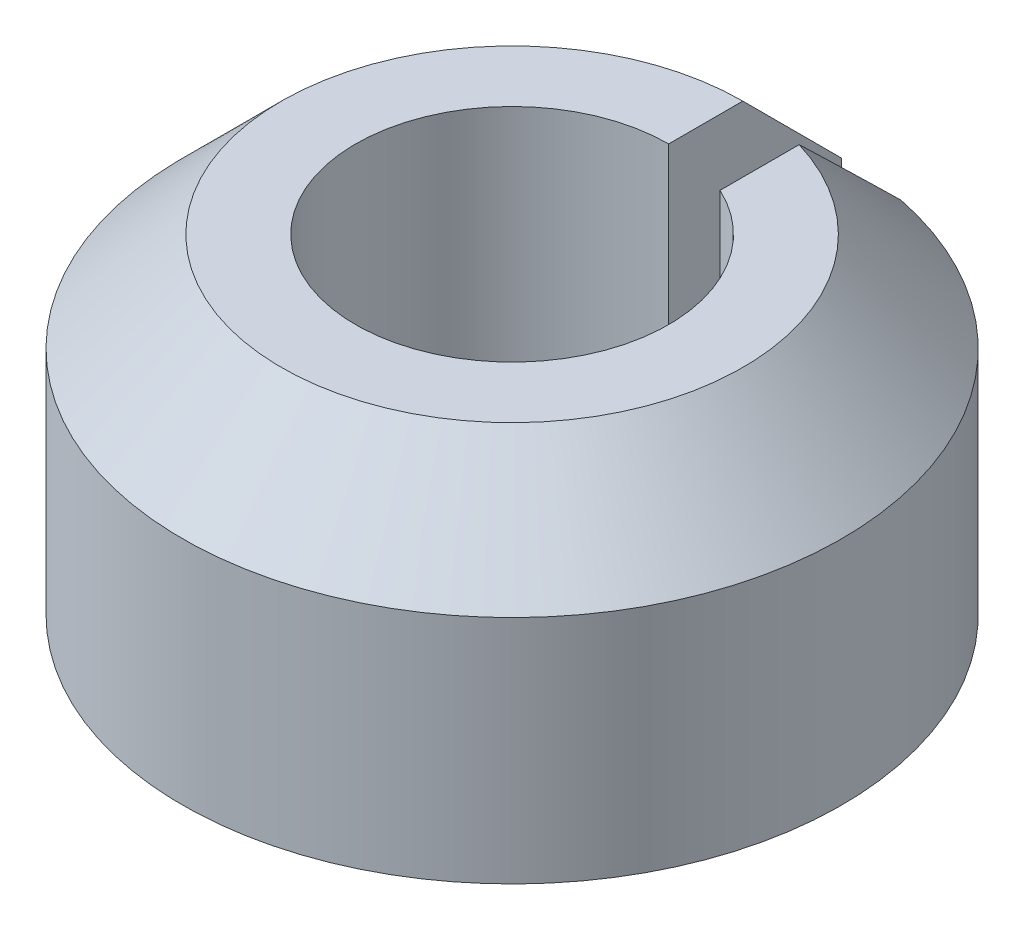
ISO-10303-21;
HEADER;
FILE_DESCRIPTION(('STEP AP214'),'2;1');
FILE_NAME('part.step','',(''),(''),'','','');
FILE_SCHEMA(('AUTOMOTIVE_DESIGN { 1 0 10303 214 1 1 1 1 }'));
ENDSEC;
DATA;
#1=APPLICATION_CONTEXT('core data for automotive mechanical design processes');
#2=APPLICATION_PROTOCOL_DEFINITION('international standard','automotive_design',2000,#1);
#3=PRODUCT_CONTEXT('',#1,'mechanical');
#4=PRODUCT('Part','Part','',(#3));
#5=PRODUCT_RELATED_PRODUCT_CATEGORY('part','',(#4));
#6=PRODUCT_DEFINITION_FORMATION('','',#4);
#7=PRODUCT_DEFINITION_CONTEXT('part definition',#1,'design');
#8=PRODUCT_DEFINITION('design','',#6,#7);
#9=PRODUCT_DEFINITION_SHAPE('','',#8);
#10=(LENGTH_UNIT() NAMED_UNIT(*) SI_UNIT(.MILLI.,.METRE.));
#11=(NAMED_UNIT(*) PLANE_ANGLE_UNIT() SI_UNIT($,.RADIAN.));
#12=(NAMED_UNIT(*) SI_UNIT($,.STERADIAN.) SOLID_ANGLE_UNIT());
#13=UNCERTAINTY_MEASURE_WITH_UNIT(LENGTH_MEASURE(1.E-05),#10,'distance_accuracy_value','');
#14=(GEOMETRIC_REPRESENTATION_CONTEXT(3) GLOBAL_UNCERTAINTY_ASSIGNED_CONTEXT((#13)) GLOBAL_UNIT_ASSIGNED_CONTEXT((#10,
#11,#12)) REPRESENTATION_CONTEXT('',''));
#15=CARTESIAN_POINT('',(0.,0.,0.));
#16=DIRECTION('',(0.,0.,1.));
#17=DIRECTION('',(1.,0.,0.));
#18=AXIS2_PLACEMENT_3D('',#15,#16,#17);
#19=CARTESIAN_POINT('',(0.,2.,0.));
#20=DIRECTION('',(0.,-1.,0.));
#21=DIRECTION('',(0.,0.,-1.));
#22=AXIS2_PLACEMENT_3D('',#19,#20,#21);
#23=CYLINDRICAL_SURFACE('',#22,0.95);
#24=CARTESIAN_POINT('',(0.,0.,0.));
#25=DIRECTION('',(0.,-1.,0.));
#26=DIRECTION('',(0.,0.,1.));
#27=AXIS2_PLACEMENT_3D('',#24,#25,#26);
#28=CIRCLE('',#27,0.95);
#29=CARTESIAN_POINT('',(0.4,0.,-0.861684396980704));
#30=VERTEX_POINT('',#29);
#31=CARTESIAN_POINT('',(0.,0.,-0.95));
#32=VERTEX_POINT('',#31);
#33=EDGE_CURVE('E112',#30,#32,#28,.T.);
#34=ORIENTED_EDGE('',*,*,#33,.T.);
#35=DIRECTION('',(0.,-1.,0.));
#36=VECTOR('',#35,1.);
#37=CARTESIAN_POINT('',(0.,2.,-0.95));
#38=LINE('',#37,#36);
#39=CARTESIAN_POINT('',(0.,2.,-0.95));
#40=VERTEX_POINT('',#39);
#41=EDGE_CURVE('E93',#40,#32,#38,.T.);
#42=ORIENTED_EDGE('',*,*,#41,.F.);
#43=CARTESIAN_POINT('',(0.,2.,0.));
#44=DIRECTION('',(0.,-1.,0.));
#45=DIRECTION('',(0.,0.,1.));
#46=AXIS2_PLACEMENT_3D('',#43,#44,#45);
#47=CIRCLE('',#46,0.95);
#48=CARTESIAN_POINT('',(0.4,2.,-0.861684396980704));
#49=VERTEX_POINT('',#48);
#50=EDGE_CURVE('E101',#49,#40,#47,.T.);
#51=ORIENTED_EDGE('',*,*,#50,.F.);
#52=DIRECTION('',(0.,-1.,0.));
#53=VECTOR('',#52,1.);
#54=CARTESIAN_POINT('',(0.4,2.,-0.861684396980704));
#55=LINE('',#54,#53);
#56=EDGE_CURVE('E196',#49,#30,#55,.T.);
#57=ORIENTED_EDGE('',*,*,#56,.T.);
#58=EDGE_LOOP('',(#34,#42,#51,#57));
#59=FACE_BOUND('',#58,.T.);
#60=ADVANCED_FACE('F40',(#59),#23,.F.);
#61=CARTESIAN_POINT('',(0.,2.,-0.95));
#62=DIRECTION('',(-1.,0.,0.));
#63=DIRECTION('',(0.,0.,1.));
#64=AXIS2_PLACEMENT_3D('',#61,#62,#63);
#65=PLANE('',#64);
#66=DIRECTION('',(0.,-1.,0.));
#67=VECTOR('',#66,1.);
#68=CARTESIAN_POINT('',(0.,2.,-2.));
#69=LINE('',#68,#67);
#70=CARTESIAN_POINT('',(0.,1.4,-2.));
#71=VERTEX_POINT('',#70);
#72=CARTESIAN_POINT('',(0.,0.,-2.));
#73=VERTEX_POINT('',#72);
#74=EDGE_CURVE('E115',#71,#73,#69,.T.);
#75=ORIENTED_EDGE('',*,*,#74,.F.);
#76=DIRECTION('',(0.,-0.707106781186549,-0.707106781186546));
#77=VECTOR('',#76,1.);
#78=CARTESIAN_POINT('',(0.,3.40000000000001,0.));
#79=LINE('',#78,#77);
#80=CARTESIAN_POINT('',(0.,2.,-1.4));
#81=VERTEX_POINT('',#80);
#82=EDGE_CURVE('E11',#71,#81,#79,.F.);
#83=ORIENTED_EDGE('',*,*,#82,.T.);
#84=DIRECTION('',(0.,0.,-1.));
#85=VECTOR('',#84,1.);
#86=CARTESIAN_POINT('',(0.,2.,-0.95));
#87=LINE('',#86,#85);
#88=EDGE_CURVE('E88',#40,#81,#87,.T.);
#89=ORIENTED_EDGE('',*,*,#88,.F.);
#90=ORIENTED_EDGE('',*,*,#41,.T.);
#91=DIRECTION('',(0.,0.,-1.));
#92=VECTOR('',#91,1.);
#93=CARTESIAN_POINT('',(0.,0.,-0.95));
#94=LINE('',#93,#92);
#95=EDGE_CURVE('E204',#32,#73,#94,.T.);
#96=ORIENTED_EDGE('',*,*,#95,.T.);
#97=EDGE_LOOP('',(#75,#83,#89,#90,#96));
#98=FACE_BOUND('',#97,.T.);
#99=ADVANCED_FACE('F90',(#98),#65,.F.);
#100=CARTESIAN_POINT('',(0.,2.,0.));
#101=DIRECTION('',(0.,-1.,0.));
#102=DIRECTION('',(0.,0.,-1.));
#103=AXIS2_PLACEMENT_3D('',#100,#101,#102);
#104=CYLINDRICAL_SURFACE('',#103,2.);
#105=DIRECTION('',(0.,-1.,0.));
#106=VECTOR('',#105,1.);
#107=CARTESIAN_POINT('',(0.4,2.,-1.95959179422654));
#108=LINE('',#107,#106);
#109=CARTESIAN_POINT('',(0.4,1.4,-1.95959179422654));
#110=VERTEX_POINT('',#109);
#111=CARTESIAN_POINT('',(0.4,0.,-1.95959179422654));
#112=VERTEX_POINT('',#111);
#113=EDGE_CURVE('E120',#110,#112,#108,.T.);
#114=ORIENTED_EDGE('',*,*,#113,.F.);
#115=CARTESIAN_POINT('',(0.,1.4,0.));
#116=DIRECTION('',(0.,1.,0.));
#117=DIRECTION('',(0.,0.,1.));
#118=AXIS2_PLACEMENT_3D('',#115,#116,#117);
#119=CIRCLE('',#118,2.);
#120=EDGE_CURVE('E51',#110,#71,#119,.F.);
#121=ORIENTED_EDGE('',*,*,#120,.T.);
#122=ORIENTED_EDGE('',*,*,#74,.T.);
#123=CARTESIAN_POINT('',(0.,0.,0.));
#124=DIRECTION('',(0.,1.,0.));
#125=DIRECTION('',(0.,0.,1.));
#126=AXIS2_PLACEMENT_3D('',#123,#124,#125);
#127=CIRCLE('',#126,2.);
#128=EDGE_CURVE('E207',#73,#112,#127,.T.);
#129=ORIENTED_EDGE('',*,*,#128,.T.);
#130=EDGE_LOOP('',(#114,#121,#122,#129));
#131=FACE_BOUND('',#130,.T.);
#132=ADVANCED_FACE('F135',(#131),#104,.T.);
#133=CARTESIAN_POINT('',(0.4,2.,-1.95959179422654));
#134=DIRECTION('',(1.,0.,0.));
#135=DIRECTION('',(0.,0.,-1.));
#136=AXIS2_PLACEMENT_3D('',#133,#134,#135);
#137=PLANE('',#136);
#138=DIRECTION('',(0.,0.,1.));
#139=VECTOR('',#138,1.);
#140=CARTESIAN_POINT('',(0.4,2.,-1.95959179422654));
#141=LINE('',#140,#139);
#142=CARTESIAN_POINT('',(0.4,2.,-1.34164078649988));
#143=VERTEX_POINT('',#142);
#144=EDGE_CURVE('E100',#143,#49,#141,.T.);
#145=ORIENTED_EDGE('',*,*,#144,.F.);
#146=CARTESIAN_POINT('',(0.4,2.,-1.34164078649988));
#147=CARTESIAN_POINT('',(0.4,1.95033365941204,-1.39345983865885));
#148=CARTESIAN_POINT('',(0.4,1.90055305549691,-1.44516900081552));
#149=CARTESIAN_POINT('',(0.4,1.80081249161614,-1.54841338046265));
#150=CARTESIAN_POINT('',(0.4,1.75085253296444,-1.59994859922209));
#151=CARTESIAN_POINT('',(0.4,1.65080187778524,-1.7028915034754));
#152=CARTESIAN_POINT('',(0.4,1.60071118171631,-1.75429918941538));
#153=CARTESIAN_POINT('',(0.4,1.50042623605726,-1.85701420084012));
#154=CARTESIAN_POINT('',(0.4,1.45023198572115,-1.90832152559669));
#155=CARTESIAN_POINT('',(0.4,1.4,-1.95959179422654));
#156=B_SPLINE_CURVE_WITH_KNOTS('',3,(#146,#147,#148,#149,#150,#151,#152,#153,#154,#155),
.UNSPECIFIED.,.F.,.F.,(4,2,2,2,4),(0.,0.215330896568315,0.430660218817488,0.645988786782878,
0.861318911383313),.UNSPECIFIED.);
#157=EDGE_CURVE('E65',#143,#110,#156,.T.);
#158=ORIENTED_EDGE('',*,*,#157,.T.);
#159=ORIENTED_EDGE('',*,*,#113,.T.);
#160=DIRECTION('',(0.,0.,1.));
#161=VECTOR('',#160,1.);
#162=CARTESIAN_POINT('',(0.4,0.,-1.95959179422654));
#163=LINE('',#162,#161);
#164=EDGE_CURVE('E109',#112,#30,#163,.T.);
#165=ORIENTED_EDGE('',*,*,#164,.T.);
#166=ORIENTED_EDGE('',*,*,#56,.F.);
#167=EDGE_LOOP('',(#145,#158,#159,#165,#166));
#168=FACE_BOUND('',#167,.T.);
#169=ADVANCED_FACE('F130',(#168),#137,.F.);
#170=CARTESIAN_POINT('',(0.,2.,0.));
#171=DIRECTION('',(0.,1.,0.));
#172=DIRECTION('',(0.,0.,1.));
#173=AXIS2_PLACEMENT_3D('',#170,#171,#172);
#174=PLANE('',#173);
#175=ORIENTED_EDGE('',*,*,#88,.T.);
#176=CARTESIAN_POINT('',(0.,2.,0.));
#177=DIRECTION('',(0.,1.,0.));
#178=DIRECTION('',(0.,0.,1.));
#179=AXIS2_PLACEMENT_3D('',#176,#177,#178);
#180=CIRCLE('',#179,1.4);
#181=EDGE_CURVE('E114',#81,#143,#180,.T.);
#182=ORIENTED_EDGE('',*,*,#181,.T.);
#183=ORIENTED_EDGE('',*,*,#144,.T.);
#184=ORIENTED_EDGE('',*,*,#50,.T.);
#185=EDGE_LOOP('',(#175,#182,#183,#184));
#186=FACE_BOUND('',#185,.T.);
#187=ADVANCED_FACE('F104',(#186),#174,.T.);
#188=CARTESIAN_POINT('',(0.,0.,0.));
#189=DIRECTION('',(0.,1.,0.));
#190=DIRECTION('',(0.,0.,1.));
#191=AXIS2_PLACEMENT_3D('',#188,#189,#190);
#192=PLANE('',#191);
#193=ORIENTED_EDGE('',*,*,#33,.F.);
#194=ORIENTED_EDGE('',*,*,#164,.F.);
#195=ORIENTED_EDGE('',*,*,#128,.F.);
#196=ORIENTED_EDGE('',*,*,#95,.F.);
#197=EDGE_LOOP('',(#193,#194,#195,#196));
#198=FACE_BOUND('',#197,.T.);
#199=ADVANCED_FACE('F136',(#198),#192,.F.);
#200=CARTESIAN_POINT('',(0.,2.,0.));
#201=DIRECTION('',(0.,-1.,0.));
#202=DIRECTION('',(0.,0.,-1.));
#203=AXIS2_PLACEMENT_3D('',#200,#201,#202);
#204=CONICAL_SURFACE('',#203,1.4,0.785398163397447);
#205=ORIENTED_EDGE('',*,*,#82,.F.);
#206=ORIENTED_EDGE('',*,*,#120,.F.);
#207=ORIENTED_EDGE('',*,*,#157,.F.);
#208=ORIENTED_EDGE('',*,*,#181,.F.);
#209=EDGE_LOOP('',(#205,#206,#207,#208));
#210=FACE_BOUND('',#209,.T.);
#211=ADVANCED_FACE('F43',(#210),#204,.T.);
#212=CLOSED_SHELL('',(#60,#99,#132,#169,#187,#199,#211));
#213=MANIFOLD_SOLID_BREP('B2',#212);
#214=ADVANCED_BREP_SHAPE_REPRESENTATION('',(#18,#213),#14);
#215=SHAPE_DEFINITION_REPRESENTATION(#9,#214);
ENDSEC;
END-ISO-10303-21;
